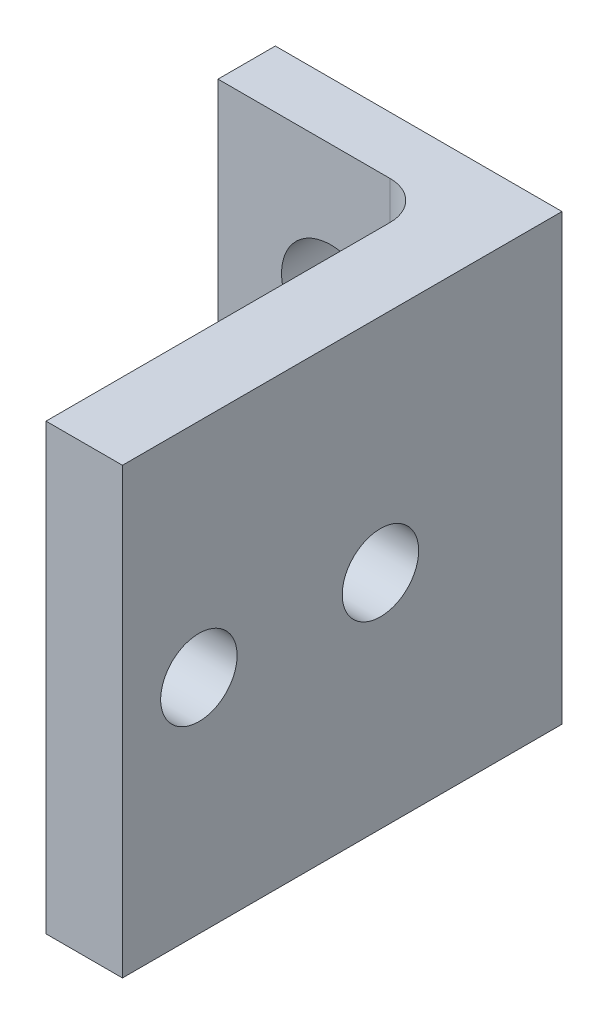
ISO-10303-21;
HEADER;
FILE_DESCRIPTION(('STEP AP214'),'2;1');
FILE_NAME('part.step','',(''),(''),'','','');
FILE_SCHEMA(('AUTOMOTIVE_DESIGN { 1 0 10303 214 1 1 1 1 }'));
ENDSEC;
DATA;
#1=APPLICATION_CONTEXT('core data for automotive mechanical design processes');
#2=APPLICATION_PROTOCOL_DEFINITION('international standard','automotive_design',2000,#1);
#3=PRODUCT_CONTEXT('',#1,'mechanical');
#4=PRODUCT('Part','Part','',(#3));
#5=PRODUCT_RELATED_PRODUCT_CATEGORY('part','',(#4));
#6=PRODUCT_DEFINITION_FORMATION('','',#4);
#7=PRODUCT_DEFINITION_CONTEXT('part definition',#1,'design');
#8=PRODUCT_DEFINITION('design','',#6,#7);
#9=PRODUCT_DEFINITION_SHAPE('','',#8);
#10=(LENGTH_UNIT() NAMED_UNIT(*) SI_UNIT(.MILLI.,.METRE.));
#11=(NAMED_UNIT(*) PLANE_ANGLE_UNIT() SI_UNIT($,.RADIAN.));
#12=(NAMED_UNIT(*) SI_UNIT($,.STERADIAN.) SOLID_ANGLE_UNIT());
#13=UNCERTAINTY_MEASURE_WITH_UNIT(LENGTH_MEASURE(1.E-05),#10,'distance_accuracy_value','');
#14=(GEOMETRIC_REPRESENTATION_CONTEXT(3) GLOBAL_UNCERTAINTY_ASSIGNED_CONTEXT((#13)) GLOBAL_UNIT_ASSIGNED_CONTEXT((#10,
#11,#12)) REPRESENTATION_CONTEXT('',''));
#15=CARTESIAN_POINT('',(0.,0.,0.));
#16=DIRECTION('',(0.,0.,1.));
#17=DIRECTION('',(1.,0.,0.));
#18=AXIS2_PLACEMENT_3D('',#15,#16,#17);
#19=CARTESIAN_POINT('',(59.33,-4.58000000000004,5.));
#20=DIRECTION('',(0.,-1.,0.));
#21=DIRECTION('',(0.,0.,-1.));
#22=AXIS2_PLACEMENT_3D('',#19,#20,#21);
#23=CYLINDRICAL_SURFACE('',#22,2.);
#24=CARTESIAN_POINT('',(59.33,7.91674105843054,3.));
#25=CARTESIAN_POINT('',(59.3946987940862,7.97230322275211,3.00000892004133));
#26=CARTESIAN_POINT('',(59.4578250908785,8.02956414965679,3.00313734690599));
#27=CARTESIAN_POINT('',(59.5805649226077,8.14703635003067,3.01480024900854));
#28=CARTESIAN_POINT('',(59.6401838781915,8.20724279246788,3.02332612898611));
#29=CARTESIAN_POINT('',(59.8124361495058,8.39071902112035,3.05556640797108));
#30=CARTESIAN_POINT('',(59.9196980681948,8.51791057931543,3.08597568486977));
#31=CARTESIAN_POINT('',(60.0967274009579,8.75123519806086,3.15095946254174));
#32=CARTESIAN_POINT('',(60.1695409676305,8.85580522862136,3.18312582887523));
#33=CARTESIAN_POINT('',(60.3059187789412,9.06925447484878,3.25259220932443));
#34=CARTESIAN_POINT('',(60.369478862493,9.17813560129932,3.2898945183798));
#35=CARTESIAN_POINT('',(60.487766369995,9.40046123586144,3.36763430138701));
#36=CARTESIAN_POINT('',(60.5424346483955,9.51393049415141,3.40809031610274));
#37=CARTESIAN_POINT('',(60.6425364985175,9.74463090296952,3.48956851522011));
#38=CARTESIAN_POINT('',(60.6879728230036,9.86186092001468,3.53059052694637));
#39=CARTESIAN_POINT('',(60.7593732440288,10.0703641677842,3.60045434565133));
#40=CARTESIAN_POINT('',(60.7873637981478,10.1607814219586,3.62977265720144));
#41=CARTESIAN_POINT('',(60.8380644624375,10.3438422020155,3.68578415330555));
#42=CARTESIAN_POINT('',(60.8607743781229,10.4364858097558,3.71247724115194));
#43=CARTESIAN_POINT('',(60.920479163949,10.7168839801523,3.78576647269357));
#44=CARTESIAN_POINT('',(60.9494947448846,10.9083910710334,3.82605139455873));
#45=CARTESIAN_POINT('',(60.9736921937295,11.1827186071613,3.86051982757825));
#46=CARTESIAN_POINT('',(60.978735980106,11.2631095558686,3.86788129026044));
#47=CARTESIAN_POINT('',(60.9847214638185,11.4243769479827,3.87664339080629));
#48=CARTESIAN_POINT('',(60.9856639176896,11.5052532990952,3.87804512800468));
#49=CARTESIAN_POINT('',(60.9834168268892,11.666901984417,3.87473778805862));
#50=CARTESIAN_POINT('',(60.9802230559087,11.7476741276891,3.87002246061552));
#51=CARTESIAN_POINT('',(60.9697789065623,11.9084125509297,3.85491993870496));
#52=CARTESIAN_POINT('',(60.9625275490379,11.9883786316392,3.84453137521202));
#53=CARTESIAN_POINT('',(60.9277651904628,12.2877849169191,3.79623735164689));
#54=CARTESIAN_POINT('',(60.8871263475976,12.5031990646845,3.74219717372138));
#55=CARTESIAN_POINT('',(60.8057083299949,12.8173020840095,3.64944183731561));
#56=CARTESIAN_POINT('',(60.7750213733945,12.9208318583202,3.61644369993934));
#57=CARTESIAN_POINT('',(60.7068880183123,13.1250771776815,3.54862642396472));
#58=CARTESIAN_POINT('',(60.6694431781567,13.2257933653578,3.51380770649286));
#59=CARTESIAN_POINT('',(60.5846720390093,13.432132977249,3.44142891519082));
#60=CARTESIAN_POINT('',(60.536804761773,13.5375316064611,3.40386556063397));
#61=CARTESIAN_POINT('',(60.4331935485272,13.7451124656548,3.33057050414249));
#62=CARTESIAN_POINT('',(60.3774468539388,13.847293553792,3.29483944969101));
#63=CARTESIAN_POINT('',(60.2583738120717,14.0475363582057,3.22721102800409));
#64=CARTESIAN_POINT('',(60.1950979521172,14.1456201492791,3.19529071330641));
#65=CARTESIAN_POINT('',(60.0606905328511,14.3378619775433,3.13681355355477));
#66=CARTESIAN_POINT('',(59.9895632017617,14.4320220904642,3.11025384326288));
#67=CARTESIAN_POINT('',(59.8274840385386,14.630539190753,3.060725816215));
#68=CARTESIAN_POINT('',(59.7351793048261,14.734129836064,3.03900436199744));
#69=CARTESIAN_POINT('',(59.5890552615156,14.8841854327796,3.01622993344528));
#70=CARTESIAN_POINT('',(59.5388713040392,14.9334862882308,3.01026947986341));
#71=CARTESIAN_POINT('',(59.4361488535375,15.030003638861,3.00215452739983));
#72=CARTESIAN_POINT('',(59.3836079529819,15.0772179002541,3.00000401537737));
#73=CARTESIAN_POINT('',(59.33,15.1232589415693,3.));
#74=B_SPLINE_CURVE_WITH_KNOTS('',3,(#24,#25,#26,#27,#28,#29,#30,#31,#32,#33,#34,#35,#36,#37,#38,
#39,#40,#41,#42,#43,#44,#45,#46,#47,#48,#49,#50,#51,#52,#53,#54,#55,#56,#57,#58,#59,#60,#61,#62,
#63,#64,#65,#66,#67,#68,#69,#70,#71,#72,#73),.UNSPECIFIED.,.F.,.F.,(4,2,2,2,2,2,2,2,2,2,2,2,2,2,
2,2,2,2,2,2,2,2,2,2,4),(0.,0.255621421961527,0.510836795976869,1.01643252369451,
1.41022267741147,1.80418936647741,2.20067797766366,2.59704819063971,2.89410422518778,
3.19117119854629,3.78100750843527,4.0233893730448,4.26572652580233,4.50831148912709,
4.75095501723499,5.42370106047154,5.76235276678166,6.10092648165144,6.46574532787401,
6.83069221475901,7.19331690343568,7.55574725326038,7.97593564687133,8.18758652919745,
8.39945876005642),.UNSPECIFIED.);
#75=CARTESIAN_POINT('',(59.33,7.91674105843054,3.));
#76=VERTEX_POINT('',#75);
#77=CARTESIAN_POINT('',(59.33,15.1232589415693,3.));
#78=VERTEX_POINT('',#77);
#79=EDGE_CURVE('E11',#76,#78,#74,.T.);
#80=ORIENTED_EDGE('',*,*,#79,.F.);
#81=DIRECTION('',(0.,-1.,0.));
#82=VECTOR('',#81,1.);
#83=CARTESIAN_POINT('',(59.33,0.,3.));
#84=LINE('',#83,#82);
#85=CARTESIAN_POINT('',(59.33,-4.58000000000003,3.));
#86=VERTEX_POINT('',#85);
#87=EDGE_CURVE('E106',#86,#76,#84,.F.);
#88=ORIENTED_EDGE('',*,*,#87,.F.);
#89=CARTESIAN_POINT('',(59.33,-4.58000000000003,5.));
#90=DIRECTION('',(0.,1.,0.));
#91=DIRECTION('',(-1.,0.,0.));
#92=AXIS2_PLACEMENT_3D('',#89,#90,#91);
#93=CIRCLE('',#92,2.);
#94=CARTESIAN_POINT('',(61.33,-4.58000000000004,5.));
#95=VERTEX_POINT('',#94);
#96=EDGE_CURVE('E59',#95,#86,#93,.T.);
#97=ORIENTED_EDGE('',*,*,#96,.F.);
#98=DIRECTION('',(0.,-1.,0.));
#99=VECTOR('',#98,1.);
#100=CARTESIAN_POINT('',(61.33,-4.58000000000004,5.));
#101=LINE('',#100,#99);
#102=CARTESIAN_POINT('',(61.33,18.6565343630836,5.));
#103=VERTEX_POINT('',#102);
#104=EDGE_CURVE('E115',#103,#95,#101,.T.);
#105=ORIENTED_EDGE('',*,*,#104,.F.);
#106=CARTESIAN_POINT('',(59.33,18.6565343630836,5.));
#107=DIRECTION('',(0.,-1.,0.));
#108=DIRECTION('',(0.,0.,-1.));
#109=AXIS2_PLACEMENT_3D('',#106,#107,#108);
#110=CIRCLE('',#109,2.);
#111=CARTESIAN_POINT('',(59.33,18.6565343630836,3.));
#112=VERTEX_POINT('',#111);
#113=EDGE_CURVE('E45',#112,#103,#110,.T.);
#114=ORIENTED_EDGE('',*,*,#113,.F.);
#115=EDGE_CURVE('E108',#78,#112,#84,.F.);
#116=ORIENTED_EDGE('',*,*,#115,.F.);
#117=EDGE_LOOP('',(#80,#88,#97,#105,#114,#116));
#118=FACE_BOUND('',#117,.T.);
#119=ADVANCED_FACE('F32',(#118),#23,.F.);
#120=CARTESIAN_POINT('',(0.,0.,3.));
#121=DIRECTION('',(0.,0.,1.));
#122=DIRECTION('',(1.,0.,0.));
#123=AXIS2_PLACEMENT_3D('',#120,#121,#122);
#124=PLANE('',#123);
#125=ORIENTED_EDGE('',*,*,#87,.T.);
#126=CARTESIAN_POINT('',(56.235,11.5199999999999,3.));
#127=DIRECTION('',(0.,0.,1.));
#128=DIRECTION('',(1.,0.,0.));
#129=AXIS2_PLACEMENT_3D('',#126,#127,#128);
#130=CIRCLE('',#129,4.75);
#131=EDGE_CURVE('E52',#76,#78,#130,.T.);
#132=ORIENTED_EDGE('',*,*,#131,.T.);
#133=ORIENTED_EDGE('',*,*,#115,.T.);
#134=DIRECTION('',(-1.,0.,0.));
#135=VECTOR('',#134,1.);
#136=CARTESIAN_POINT('',(50.33,18.6565343630836,3.));
#137=LINE('',#136,#135);
#138=CARTESIAN_POINT('',(50.33,18.6565343630836,3.));
#139=VERTEX_POINT('',#138);
#140=EDGE_CURVE('E127',#112,#139,#137,.T.);
#141=ORIENTED_EDGE('',*,*,#140,.T.);
#142=DIRECTION('',(0.,-1.,0.));
#143=VECTOR('',#142,1.);
#144=CARTESIAN_POINT('',(50.33,18.6565343630836,3.));
#145=LINE('',#144,#143);
#146=CARTESIAN_POINT('',(50.33,-4.58000000000004,3.));
#147=VERTEX_POINT('',#146);
#148=EDGE_CURVE('E153',#139,#147,#145,.T.);
#149=ORIENTED_EDGE('',*,*,#148,.T.);
#150=DIRECTION('',(1.,0.,0.));
#151=VECTOR('',#150,1.);
#152=CARTESIAN_POINT('',(50.33,-4.58000000000004,3.));
#153=LINE('',#152,#151);
#154=EDGE_CURVE('E112',#147,#86,#153,.T.);
#155=ORIENTED_EDGE('',*,*,#154,.T.);
#156=EDGE_LOOP('',(#125,#132,#133,#141,#149,#155));
#157=FACE_BOUND('',#156,.T.);
#158=CARTESIAN_POINT('',(56.235,11.5199999999999,3.));
#159=DIRECTION('',(0.,0.,1.));
#160=DIRECTION('',(1.,0.,0.));
#161=AXIS2_PLACEMENT_3D('',#158,#159,#160);
#162=CIRCLE('',#161,2.58);
#163=CARTESIAN_POINT('',(58.815,11.5199999999999,3.));
#164=VERTEX_POINT('',#163);
#165=EDGE_CURVE('E160',#164,#164,#162,.T.);
#166=ORIENTED_EDGE('',*,*,#165,.F.);
#167=EDGE_LOOP('',(#166));
#168=FACE_BOUND('',#167,.T.);
#169=ADVANCED_FACE('F109',(#157,#168),#124,.T.);
#170=CARTESIAN_POINT('',(0.,0.,0.));
#171=DIRECTION('',(0.,0.,1.));
#172=DIRECTION('',(1.,0.,0.));
#173=AXIS2_PLACEMENT_3D('',#170,#171,#172);
#174=PLANE('',#173);
#175=DIRECTION('',(0.,-1.,0.));
#176=VECTOR('',#175,1.);
#177=CARTESIAN_POINT('',(50.33,18.6565343630836,0.));
#178=LINE('',#177,#176);
#179=CARTESIAN_POINT('',(50.33,18.6565343630836,0.));
#180=VERTEX_POINT('',#179);
#181=CARTESIAN_POINT('',(50.33,-4.58000000000004,0.));
#182=VERTEX_POINT('',#181);
#183=EDGE_CURVE('E158',#180,#182,#178,.T.);
#184=ORIENTED_EDGE('',*,*,#183,.F.);
#185=DIRECTION('',(-1.,0.,0.));
#186=VECTOR('',#185,1.);
#187=CARTESIAN_POINT('',(50.33,18.6565343630836,0.));
#188=LINE('',#187,#186);
#189=CARTESIAN_POINT('',(65.33,18.6565343630836,0.));
#190=VERTEX_POINT('',#189);
#191=EDGE_CURVE('E151',#190,#180,#188,.T.);
#192=ORIENTED_EDGE('',*,*,#191,.F.);
#193=DIRECTION('',(0.,1.,0.));
#194=VECTOR('',#193,1.);
#195=CARTESIAN_POINT('',(65.33,18.6565343630836,0.));
#196=LINE('',#195,#194);
#197=CARTESIAN_POINT('',(65.33,-4.58000000000003,0.));
#198=VERTEX_POINT('',#197);
#199=EDGE_CURVE('E154',#198,#190,#196,.T.);
#200=ORIENTED_EDGE('',*,*,#199,.F.);
#201=DIRECTION('',(1.,0.,0.));
#202=VECTOR('',#201,1.);
#203=CARTESIAN_POINT('',(50.33,-4.58000000000004,0.));
#204=LINE('',#203,#202);
#205=EDGE_CURVE('E156',#182,#198,#204,.T.);
#206=ORIENTED_EDGE('',*,*,#205,.F.);
#207=EDGE_LOOP('',(#184,#192,#200,#206));
#208=FACE_BOUND('',#207,.T.);
#209=CARTESIAN_POINT('',(56.235,11.5199999999999,0.));
#210=DIRECTION('',(0.,0.,1.));
#211=DIRECTION('',(1.,0.,0.));
#212=AXIS2_PLACEMENT_3D('',#209,#210,#211);
#213=CIRCLE('',#212,2.58);
#214=CARTESIAN_POINT('',(58.815,11.5199999999999,0.));
#215=VERTEX_POINT('',#214);
#216=EDGE_CURVE('E134',#215,#215,#213,.T.);
#217=ORIENTED_EDGE('',*,*,#216,.T.);
#218=EDGE_LOOP('',(#217));
#219=FACE_BOUND('',#218,.T.);
#220=ADVANCED_FACE('F211',(#208,#219),#174,.F.);
#221=CARTESIAN_POINT('',(50.33,18.6565343630836,3.));
#222=DIRECTION('',(1.,0.,0.));
#223=DIRECTION('',(0.,0.,-1.));
#224=AXIS2_PLACEMENT_3D('',#221,#222,#223);
#225=PLANE('',#224);
#226=ORIENTED_EDGE('',*,*,#183,.T.);
#227=DIRECTION('',(0.,0.,-1.));
#228=VECTOR('',#227,1.);
#229=CARTESIAN_POINT('',(50.33,-4.58000000000004,3.));
#230=LINE('',#229,#228);
#231=EDGE_CURVE('E137',#147,#182,#230,.T.);
#232=ORIENTED_EDGE('',*,*,#231,.F.);
#233=ORIENTED_EDGE('',*,*,#148,.F.);
#234=DIRECTION('',(0.,0.,-1.));
#235=VECTOR('',#234,1.);
#236=CARTESIAN_POINT('',(50.33,18.6565343630836,3.));
#237=LINE('',#236,#235);
#238=EDGE_CURVE('E148',#139,#180,#237,.T.);
#239=ORIENTED_EDGE('',*,*,#238,.T.);
#240=EDGE_LOOP('',(#226,#232,#233,#239));
#241=FACE_BOUND('',#240,.T.);
#242=ADVANCED_FACE('F214',(#241),#225,.F.);
#243=CARTESIAN_POINT('',(50.33,-4.58000000000004,3.));
#244=DIRECTION('',(0.,1.,0.));
#245=DIRECTION('',(-1.,0.,0.));
#246=AXIS2_PLACEMENT_3D('',#243,#244,#245);
#247=PLANE('',#246);
#248=ORIENTED_EDGE('',*,*,#205,.T.);
#249=DIRECTION('',(0.,0.,-1.));
#250=VECTOR('',#249,1.);
#251=CARTESIAN_POINT('',(65.33,-4.58000000000003,3.));
#252=LINE('',#251,#250);
#253=CARTESIAN_POINT('',(65.33,-4.58000000000003,23.));
#254=VERTEX_POINT('',#253);
#255=EDGE_CURVE('E139',#254,#198,#252,.T.);
#256=ORIENTED_EDGE('',*,*,#255,.F.);
#257=DIRECTION('',(1.,0.,0.));
#258=VECTOR('',#257,1.);
#259=CARTESIAN_POINT('',(65.33,-4.58000000000003,23.));
#260=LINE('',#259,#258);
#261=CARTESIAN_POINT('',(61.33,-4.58000000000004,23.));
#262=VERTEX_POINT('',#261);
#263=EDGE_CURVE('E169',#262,#254,#260,.T.);
#264=ORIENTED_EDGE('',*,*,#263,.F.);
#265=DIRECTION('',(0.,0.,-1.));
#266=VECTOR('',#265,1.);
#267=CARTESIAN_POINT('',(61.33,-4.58000000000004,23.));
#268=LINE('',#267,#266);
#269=EDGE_CURVE('E135',#262,#95,#268,.T.);
#270=ORIENTED_EDGE('',*,*,#269,.T.);
#271=ORIENTED_EDGE('',*,*,#96,.T.);
#272=ORIENTED_EDGE('',*,*,#154,.F.);
#273=ORIENTED_EDGE('',*,*,#231,.T.);
#274=EDGE_LOOP('',(#248,#256,#264,#270,#271,#272,#273));
#275=FACE_BOUND('',#274,.T.);
#276=ADVANCED_FACE('F202',(#275),#247,.F.);
#277=CARTESIAN_POINT('',(65.33,18.6565343630836,3.));
#278=DIRECTION('',(-1.,0.,0.));
#279=DIRECTION('',(0.,0.,1.));
#280=AXIS2_PLACEMENT_3D('',#277,#278,#279);
#281=PLANE('',#280);
#282=CARTESIAN_POINT('',(65.33,7.03826718154177,19.));
#283=DIRECTION('',(1.,0.,0.));
#284=DIRECTION('',(0.,0.,-1.));
#285=AXIS2_PLACEMENT_3D('',#282,#283,#284);
#286=CIRCLE('',#285,2.);
#287=CARTESIAN_POINT('',(65.33,7.03826718154177,17.));
#288=VERTEX_POINT('',#287);
#289=EDGE_CURVE('E184',#288,#288,#286,.T.);
#290=ORIENTED_EDGE('',*,*,#289,.F.);
#291=EDGE_LOOP('',(#290));
#292=FACE_BOUND('',#291,.T.);
#293=CARTESIAN_POINT('',(65.33,7.03826718154177,9.50000000000001));
#294=DIRECTION('',(1.,0.,0.));
#295=DIRECTION('',(0.,0.,-1.));
#296=AXIS2_PLACEMENT_3D('',#293,#294,#295);
#297=CIRCLE('',#296,2.);
#298=CARTESIAN_POINT('',(65.33,7.03826718154177,7.50000000000001));
#299=VERTEX_POINT('',#298);
#300=EDGE_CURVE('E102',#299,#299,#297,.T.);
#301=ORIENTED_EDGE('',*,*,#300,.F.);
#302=EDGE_LOOP('',(#301));
#303=FACE_BOUND('',#302,.T.);
#304=ORIENTED_EDGE('',*,*,#199,.T.);
#305=DIRECTION('',(0.,0.,-1.));
#306=VECTOR('',#305,1.);
#307=CARTESIAN_POINT('',(65.33,18.6565343630836,3.));
#308=LINE('',#307,#306);
#309=CARTESIAN_POINT('',(65.33,18.6565343630836,23.));
#310=VERTEX_POINT('',#309);
#311=EDGE_CURVE('E143',#310,#190,#308,.T.);
#312=ORIENTED_EDGE('',*,*,#311,.F.);
#313=DIRECTION('',(0.,1.,0.));
#314=VECTOR('',#313,1.);
#315=CARTESIAN_POINT('',(65.33,-4.58000000000003,23.));
#316=LINE('',#315,#314);
#317=EDGE_CURVE('E175',#254,#310,#316,.T.);
#318=ORIENTED_EDGE('',*,*,#317,.F.);
#319=ORIENTED_EDGE('',*,*,#255,.T.);
#320=EDGE_LOOP('',(#304,#312,#318,#319));
#321=FACE_BOUND('',#320,.T.);
#322=ADVANCED_FACE('F199',(#292,#303,#321),#281,.F.);
#323=CARTESIAN_POINT('',(50.33,18.6565343630836,3.));
#324=DIRECTION('',(0.,-1.,0.));
#325=DIRECTION('',(0.,0.,-1.));
#326=AXIS2_PLACEMENT_3D('',#323,#324,#325);
#327=PLANE('',#326);
#328=ORIENTED_EDGE('',*,*,#191,.T.);
#329=ORIENTED_EDGE('',*,*,#238,.F.);
#330=ORIENTED_EDGE('',*,*,#140,.F.);
#331=ORIENTED_EDGE('',*,*,#113,.T.);
#332=DIRECTION('',(0.,0.,-1.));
#333=VECTOR('',#332,1.);
#334=CARTESIAN_POINT('',(61.33,18.6565343630836,23.));
#335=LINE('',#334,#333);
#336=CARTESIAN_POINT('',(61.33,18.6565343630836,23.));
#337=VERTEX_POINT('',#336);
#338=EDGE_CURVE('E124',#337,#103,#335,.T.);
#339=ORIENTED_EDGE('',*,*,#338,.F.);
#340=DIRECTION('',(-1.,0.,0.));
#341=VECTOR('',#340,1.);
#342=CARTESIAN_POINT('',(65.33,18.6565343630836,23.));
#343=LINE('',#342,#341);
#344=EDGE_CURVE('E173',#310,#337,#343,.T.);
#345=ORIENTED_EDGE('',*,*,#344,.F.);
#346=ORIENTED_EDGE('',*,*,#311,.T.);
#347=EDGE_LOOP('',(#328,#329,#330,#331,#339,#345,#346));
#348=FACE_BOUND('',#347,.T.);
#349=ADVANCED_FACE('F122',(#348),#327,.F.);
#350=CARTESIAN_POINT('',(56.235,11.5199999999999,3.));
#351=DIRECTION('',(0.,0.,-1.));
#352=DIRECTION('',(-1.,0.,0.));
#353=AXIS2_PLACEMENT_3D('',#350,#351,#352);
#354=CYLINDRICAL_SURFACE('',#353,2.58);
#355=ORIENTED_EDGE('',*,*,#165,.T.);
#356=EDGE_LOOP('',(#355));
#357=FACE_BOUND('',#356,.T.);
#358=ORIENTED_EDGE('',*,*,#216,.F.);
#359=EDGE_LOOP('',(#358));
#360=FACE_BOUND('',#359,.T.);
#361=ADVANCED_FACE('F231',(#357,#360),#354,.F.);
#362=CARTESIAN_POINT('',(61.33,-4.58000000000004,23.));
#363=DIRECTION('',(1.,0.,0.));
#364=DIRECTION('',(0.,0.,-1.));
#365=AXIS2_PLACEMENT_3D('',#362,#363,#364);
#366=PLANE('',#365);
#367=CARTESIAN_POINT('',(61.33,7.03826718154177,19.));
#368=DIRECTION('',(1.,0.,0.));
#369=DIRECTION('',(0.,0.,-1.));
#370=AXIS2_PLACEMENT_3D('',#367,#368,#369);
#371=CIRCLE('',#370,2.);
#372=CARTESIAN_POINT('',(61.33,7.03826718154177,17.));
#373=VERTEX_POINT('',#372);
#374=EDGE_CURVE('E178',#373,#373,#371,.T.);
#375=ORIENTED_EDGE('',*,*,#374,.T.);
#376=EDGE_LOOP('',(#375));
#377=FACE_BOUND('',#376,.T.);
#378=CARTESIAN_POINT('',(61.33,7.03826718154177,9.50000000000001));
#379=DIRECTION('',(1.,0.,0.));
#380=DIRECTION('',(0.,0.,-1.));
#381=AXIS2_PLACEMENT_3D('',#378,#379,#380);
#382=CIRCLE('',#381,2.);
#383=CARTESIAN_POINT('',(61.33,7.03826718154177,7.50000000000001));
#384=VERTEX_POINT('',#383);
#385=EDGE_CURVE('E181',#384,#384,#382,.T.);
#386=ORIENTED_EDGE('',*,*,#385,.T.);
#387=EDGE_LOOP('',(#386));
#388=FACE_BOUND('',#387,.T.);
#389=ORIENTED_EDGE('',*,*,#338,.T.);
#390=ORIENTED_EDGE('',*,*,#104,.T.);
#391=ORIENTED_EDGE('',*,*,#269,.F.);
#392=DIRECTION('',(0.,-1.,0.));
#393=VECTOR('',#392,1.);
#394=CARTESIAN_POINT('',(61.33,-4.58000000000004,23.));
#395=LINE('',#394,#393);
#396=EDGE_CURVE('E133',#337,#262,#395,.T.);
#397=ORIENTED_EDGE('',*,*,#396,.F.);
#398=EDGE_LOOP('',(#389,#390,#391,#397));
#399=FACE_BOUND('',#398,.T.);
#400=ADVANCED_FACE('F131',(#377,#388,#399),#366,.F.);
#401=CARTESIAN_POINT('',(0.,0.,23.));
#402=DIRECTION('',(0.,0.,1.));
#403=DIRECTION('',(1.,0.,0.));
#404=AXIS2_PLACEMENT_3D('',#401,#402,#403);
#405=PLANE('',#404);
#406=ORIENTED_EDGE('',*,*,#317,.T.);
#407=ORIENTED_EDGE('',*,*,#344,.T.);
#408=ORIENTED_EDGE('',*,*,#396,.T.);
#409=ORIENTED_EDGE('',*,*,#263,.T.);
#410=EDGE_LOOP('',(#406,#407,#408,#409));
#411=FACE_BOUND('',#410,.T.);
#412=ADVANCED_FACE('F242',(#411),#405,.T.);
#413=CARTESIAN_POINT('',(61.33,7.03826718154177,9.50000000000001));
#414=DIRECTION('',(1.,0.,0.));
#415=DIRECTION('',(0.,0.,-1.));
#416=AXIS2_PLACEMENT_3D('',#413,#414,#415);
#417=CYLINDRICAL_SURFACE('',#416,2.);
#418=ORIENTED_EDGE('',*,*,#385,.F.);
#419=EDGE_LOOP('',(#418));
#420=FACE_BOUND('',#419,.T.);
#421=ORIENTED_EDGE('',*,*,#300,.T.);
#422=EDGE_LOOP('',(#421));
#423=FACE_BOUND('',#422,.T.);
#424=ADVANCED_FACE('F195',(#420,#423),#417,.F.);
#425=CARTESIAN_POINT('',(61.33,7.03826718154177,19.));
#426=DIRECTION('',(1.,0.,0.));
#427=DIRECTION('',(0.,0.,-1.));
#428=AXIS2_PLACEMENT_3D('',#425,#426,#427);
#429=CYLINDRICAL_SURFACE('',#428,2.);
#430=ORIENTED_EDGE('',*,*,#374,.F.);
#431=EDGE_LOOP('',(#430));
#432=FACE_BOUND('',#431,.T.);
#433=ORIENTED_EDGE('',*,*,#289,.T.);
#434=EDGE_LOOP('',(#433));
#435=FACE_BOUND('',#434,.T.);
#436=ADVANCED_FACE('F192',(#432,#435),#429,.F.);
#437=CARTESIAN_POINT('',(56.235,11.5199999999999,7.));
#438=DIRECTION('',(0.,0.,-1.));
#439=DIRECTION('',(-1.,0.,0.));
#440=AXIS2_PLACEMENT_3D('',#437,#438,#439);
#441=CYLINDRICAL_SURFACE('',#440,4.75);
#442=ORIENTED_EDGE('',*,*,#79,.T.);
#443=ORIENTED_EDGE('',*,*,#131,.F.);
#444=EDGE_LOOP('',(#442,#443));
#445=FACE_BOUND('',#444,.T.);
#446=ADVANCED_FACE('F100',(#445),#441,.F.);
#447=CLOSED_SHELL('',(#119,#169,#220,#242,#276,#322,#349,#361,#400,#412,#424,#436,#446));
#448=MANIFOLD_SOLID_BREP('B2',#447);
#449=ADVANCED_BREP_SHAPE_REPRESENTATION('',(#18,#448),#14);
#450=SHAPE_DEFINITION_REPRESENTATION(#9,#449);
ENDSEC;
END-ISO-10303-21;
